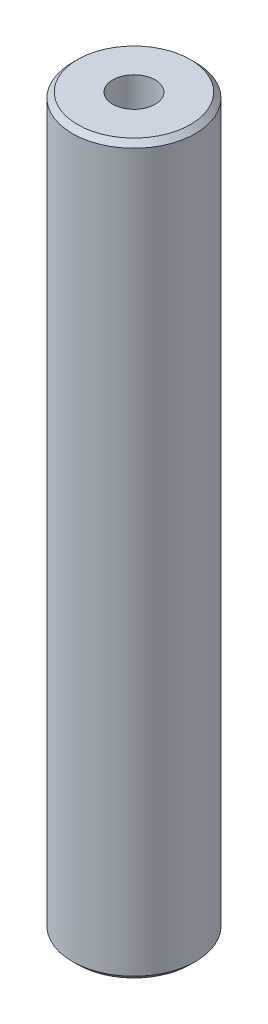
ISO-10303-21;
HEADER;
FILE_DESCRIPTION(('STEP AP214'),'2;1');
FILE_NAME('part.step','',(''),(''),'','','');
FILE_SCHEMA(('AUTOMOTIVE_DESIGN { 1 0 10303 214 1 1 1 1 }'));
ENDSEC;
DATA;
#1=APPLICATION_CONTEXT('core data for automotive mechanical design processes');
#2=APPLICATION_PROTOCOL_DEFINITION('international standard','automotive_design',2000,#1);
#3=PRODUCT_CONTEXT('',#1,'mechanical');
#4=PRODUCT('Part','Part','',(#3));
#5=PRODUCT_RELATED_PRODUCT_CATEGORY('part','',(#4));
#6=PRODUCT_DEFINITION_FORMATION('','',#4);
#7=PRODUCT_DEFINITION_CONTEXT('part definition',#1,'design');
#8=PRODUCT_DEFINITION('design','',#6,#7);
#9=PRODUCT_DEFINITION_SHAPE('','',#8);
#10=(LENGTH_UNIT() NAMED_UNIT(*) SI_UNIT(.MILLI.,.METRE.));
#11=(NAMED_UNIT(*) PLANE_ANGLE_UNIT() SI_UNIT($,.RADIAN.));
#12=(NAMED_UNIT(*) SI_UNIT($,.STERADIAN.) SOLID_ANGLE_UNIT());
#13=UNCERTAINTY_MEASURE_WITH_UNIT(LENGTH_MEASURE(1.E-05),#10,'distance_accuracy_value','');
#14=(GEOMETRIC_REPRESENTATION_CONTEXT(3) GLOBAL_UNCERTAINTY_ASSIGNED_CONTEXT((#13)) GLOBAL_UNIT_ASSIGNED_CONTEXT((#10,
#11,#12)) REPRESENTATION_CONTEXT('',''));
#15=CARTESIAN_POINT('',(0.,0.,0.));
#16=DIRECTION('',(0.,0.,1.));
#17=DIRECTION('',(1.,0.,0.));
#18=AXIS2_PLACEMENT_3D('',#15,#16,#17);
#19=CARTESIAN_POINT('',(0.,590.686894059519,0.));
#20=DIRECTION('',(0.,-1.,0.));
#21=DIRECTION('',(0.,0.,-1.));
#22=AXIS2_PLACEMENT_3D('',#19,#20,#21);
#23=CYLINDRICAL_SURFACE('',#22,50.);
#24=CARTESIAN_POINT('',(0.,586.479883065296,0.));
#25=DIRECTION('',(0.,1.,0.));
#26=DIRECTION('',(0.,0.,1.));
#27=AXIS2_PLACEMENT_3D('',#24,#25,#26);
#28=CIRCLE('',#27,50.);
#29=CARTESIAN_POINT('',(0.,586.479883065296,50.));
#30=VERTEX_POINT('',#29);
#31=EDGE_CURVE('E50',#30,#30,#28,.F.);
#32=ORIENTED_EDGE('',*,*,#31,.T.);
#33=EDGE_LOOP('',(#32));
#34=FACE_BOUND('',#33,.T.);
#35=CARTESIAN_POINT('',(0.,4.20701099422316,0.));
#36=DIRECTION('',(0.,1.,0.));
#37=DIRECTION('',(0.,0.,1.));
#38=AXIS2_PLACEMENT_3D('',#35,#36,#37);
#39=CIRCLE('',#38,50.);
#40=CARTESIAN_POINT('',(0.,4.20701099422316,50.));
#41=VERTEX_POINT('',#40);
#42=EDGE_CURVE('E51',#41,#41,#39,.T.);
#43=ORIENTED_EDGE('',*,*,#42,.T.);
#44=EDGE_LOOP('',(#43));
#45=FACE_BOUND('',#44,.T.);
#46=ADVANCED_FACE('F39',(#34,#45),#23,.T.);
#47=CARTESIAN_POINT('',(0.,590.686894059519,0.));
#48=DIRECTION('',(0.,1.,0.));
#49=DIRECTION('',(0.,0.,1.));
#50=AXIS2_PLACEMENT_3D('',#47,#48,#49);
#51=PLANE('',#50);
#52=CARTESIAN_POINT('',(0.,590.686894059519,0.));
#53=DIRECTION('',(0.,1.,0.));
#54=DIRECTION('',(0.,0.,1.));
#55=AXIS2_PLACEMENT_3D('',#52,#53,#54);
#56=CIRCLE('',#55,45.7929890057769);
#57=CARTESIAN_POINT('',(0.,590.686894059519,45.7929890057769));
#58=VERTEX_POINT('',#57);
#59=EDGE_CURVE('E54',#58,#58,#56,.T.);
#60=ORIENTED_EDGE('',*,*,#59,.T.);
#61=EDGE_LOOP('',(#60));
#62=FACE_BOUND('',#61,.T.);
#63=CARTESIAN_POINT('',(0.,590.686894059519,0.));
#64=DIRECTION('',(0.,1.,0.));
#65=DIRECTION('',(0.,0.,1.));
#66=AXIS2_PLACEMENT_3D('',#63,#64,#65);
#67=CIRCLE('',#66,17.2144993847594);
#68=CARTESIAN_POINT('',(0.,590.686894059519,17.2144993847594));
#69=VERTEX_POINT('',#68);
#70=EDGE_CURVE('E58',#69,#69,#67,.T.);
#71=ORIENTED_EDGE('',*,*,#70,.F.);
#72=EDGE_LOOP('',(#71));
#73=FACE_BOUND('',#72,.T.);
#74=ADVANCED_FACE('F69',(#62,#73),#51,.T.);
#75=CARTESIAN_POINT('',(0.,0.,0.));
#76=DIRECTION('',(0.,1.,0.));
#77=DIRECTION('',(0.,0.,1.));
#78=AXIS2_PLACEMENT_3D('',#75,#76,#77);
#79=PLANE('',#78);
#80=CARTESIAN_POINT('',(0.,0.,0.));
#81=DIRECTION('',(0.,1.,0.));
#82=DIRECTION('',(0.,0.,1.));
#83=AXIS2_PLACEMENT_3D('',#80,#81,#82);
#84=CIRCLE('',#83,45.7929890057769);
#85=CARTESIAN_POINT('',(0.,0.,45.7929890057769));
#86=VERTEX_POINT('',#85);
#87=EDGE_CURVE('E10',#86,#86,#84,.F.);
#88=ORIENTED_EDGE('',*,*,#87,.T.);
#89=EDGE_LOOP('',(#88));
#90=FACE_BOUND('',#89,.T.);
#91=CARTESIAN_POINT('',(0.,0.,0.));
#92=DIRECTION('',(0.,1.,0.));
#93=DIRECTION('',(0.,0.,1.));
#94=AXIS2_PLACEMENT_3D('',#91,#92,#93);
#95=CIRCLE('',#94,17.2144993847594);
#96=CARTESIAN_POINT('',(0.,0.,17.2144993847594));
#97=VERTEX_POINT('',#96);
#98=EDGE_CURVE('E63',#97,#97,#95,.T.);
#99=ORIENTED_EDGE('',*,*,#98,.T.);
#100=EDGE_LOOP('',(#99));
#101=FACE_BOUND('',#100,.T.);
#102=ADVANCED_FACE('F75',(#90,#101),#79,.F.);
#103=CARTESIAN_POINT('',(0.,590.686894059519,0.));
#104=DIRECTION('',(0.,-1.,0.));
#105=DIRECTION('',(0.,0.,-1.));
#106=AXIS2_PLACEMENT_3D('',#103,#104,#105);
#107=CYLINDRICAL_SURFACE('',#106,17.2144993847594);
#108=ORIENTED_EDGE('',*,*,#70,.T.);
#109=EDGE_LOOP('',(#108));
#110=FACE_BOUND('',#109,.T.);
#111=ORIENTED_EDGE('',*,*,#98,.F.);
#112=EDGE_LOOP('',(#111));
#113=FACE_BOUND('',#112,.T.);
#114=ADVANCED_FACE('F70',(#110,#113),#107,.F.);
#115=CARTESIAN_POINT('',(0.,590.686894059519,0.));
#116=DIRECTION('',(0.,-1.,0.));
#117=DIRECTION('',(0.,0.,-1.));
#118=AXIS2_PLACEMENT_3D('',#115,#116,#117);
#119=CONICAL_SURFACE('',#118,45.7929890057769,0.78539816339745);
#120=ORIENTED_EDGE('',*,*,#31,.F.);
#121=EDGE_LOOP('',(#120));
#122=FACE_BOUND('',#121,.T.);
#123=ORIENTED_EDGE('',*,*,#59,.F.);
#124=EDGE_LOOP('',(#123));
#125=FACE_BOUND('',#124,.T.);
#126=ADVANCED_FACE('F81',(#122,#125),#119,.T.);
#127=CARTESIAN_POINT('',(0.,4.20701099422316,0.));
#128=DIRECTION('',(0.,1.,0.));
#129=DIRECTION('',(0.,0.,1.));
#130=AXIS2_PLACEMENT_3D('',#127,#128,#129);
#131=CONICAL_SURFACE('',#130,50.,0.785398163397443);
#132=ORIENTED_EDGE('',*,*,#87,.F.);
#133=EDGE_LOOP('',(#132));
#134=FACE_BOUND('',#133,.T.);
#135=ORIENTED_EDGE('',*,*,#42,.F.);
#136=EDGE_LOOP('',(#135));
#137=FACE_BOUND('',#136,.T.);
#138=ADVANCED_FACE('F45',(#134,#137),#131,.T.);
#139=CLOSED_SHELL('',(#46,#74,#102,#114,#126,#138));
#140=MANIFOLD_SOLID_BREP('B2',#139);
#141=ADVANCED_BREP_SHAPE_REPRESENTATION('',(#18,#140),#14);
#142=SHAPE_DEFINITION_REPRESENTATION(#9,#141);
ENDSEC;
END-ISO-10303-21;
